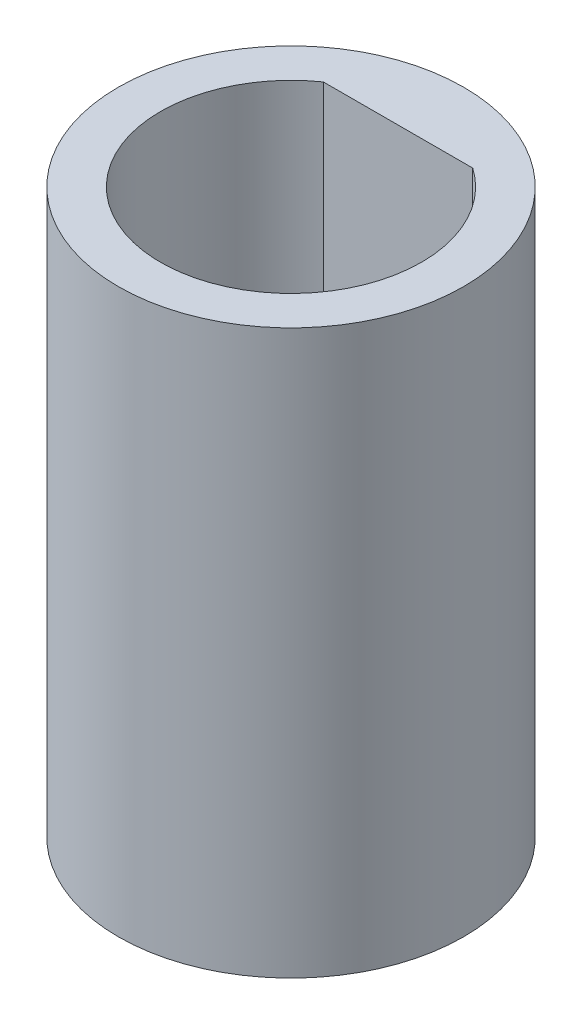
ISO-10303-21;
HEADER;
FILE_DESCRIPTION(('STEP AP214'),'2;1');
FILE_NAME('part.step','',(''),(''),'','','');
FILE_SCHEMA(('AUTOMOTIVE_DESIGN { 1 0 10303 214 1 1 1 1 }'));
ENDSEC;
DATA;
#1=APPLICATION_CONTEXT('core data for automotive mechanical design processes');
#2=APPLICATION_PROTOCOL_DEFINITION('international standard','automotive_design',2000,#1);
#3=PRODUCT_CONTEXT('',#1,'mechanical');
#4=PRODUCT('Part','Part','',(#3));
#5=PRODUCT_RELATED_PRODUCT_CATEGORY('part','',(#4));
#6=PRODUCT_DEFINITION_FORMATION('','',#4);
#7=PRODUCT_DEFINITION_CONTEXT('part definition',#1,'design');
#8=PRODUCT_DEFINITION('design','',#6,#7);
#9=PRODUCT_DEFINITION_SHAPE('','',#8);
#10=(LENGTH_UNIT() NAMED_UNIT(*) SI_UNIT(.MILLI.,.METRE.));
#11=(NAMED_UNIT(*) PLANE_ANGLE_UNIT() SI_UNIT($,.RADIAN.));
#12=(NAMED_UNIT(*) SI_UNIT($,.STERADIAN.) SOLID_ANGLE_UNIT());
#13=UNCERTAINTY_MEASURE_WITH_UNIT(LENGTH_MEASURE(1.E-05),#10,'distance_accuracy_value','');
#14=(GEOMETRIC_REPRESENTATION_CONTEXT(3) GLOBAL_UNCERTAINTY_ASSIGNED_CONTEXT((#13)) GLOBAL_UNIT_ASSIGNED_CONTEXT((#10,
#11,#12)) REPRESENTATION_CONTEXT('',''));
#15=CARTESIAN_POINT('',(0.,0.,0.));
#16=DIRECTION('',(0.,0.,1.));
#17=DIRECTION('',(1.,0.,0.));
#18=AXIS2_PLACEMENT_3D('',#15,#16,#17);
#19=CARTESIAN_POINT('',(0.,19.05,0.));
#20=DIRECTION('',(0.,-1.,0.));
#21=DIRECTION('',(0.,0.,-1.));
#22=AXIS2_PLACEMENT_3D('',#19,#20,#21);
#23=CYLINDRICAL_SURFACE('',#22,5.842);
#24=CARTESIAN_POINT('',(0.,19.05,0.));
#25=DIRECTION('',(0.,1.,0.));
#26=DIRECTION('',(0.,0.,1.));
#27=AXIS2_PLACEMENT_3D('',#24,#25,#26);
#28=CIRCLE('',#27,5.842);
#29=CARTESIAN_POINT('',(0.,19.05,5.842));
#30=VERTEX_POINT('',#29);
#31=EDGE_CURVE('E75',#30,#30,#28,.T.);
#32=ORIENTED_EDGE('',*,*,#31,.F.);
#33=EDGE_LOOP('',(#32));
#34=FACE_BOUND('',#33,.T.);
#35=CARTESIAN_POINT('',(0.,0.,0.));
#36=DIRECTION('',(0.,1.,0.));
#37=DIRECTION('',(0.,0.,1.));
#38=AXIS2_PLACEMENT_3D('',#35,#36,#37);
#39=CIRCLE('',#38,5.842);
#40=CARTESIAN_POINT('',(0.,0.,5.842));
#41=VERTEX_POINT('',#40);
#42=EDGE_CURVE('E62',#41,#41,#39,.T.);
#43=ORIENTED_EDGE('',*,*,#42,.T.);
#44=EDGE_LOOP('',(#43));
#45=FACE_BOUND('',#44,.T.);
#46=ADVANCED_FACE('F34',(#34,#45),#23,.T.);
#47=CARTESIAN_POINT('',(0.,19.05,0.));
#48=DIRECTION('',(0.,1.,0.));
#49=DIRECTION('',(0.,0.,1.));
#50=AXIS2_PLACEMENT_3D('',#47,#48,#49);
#51=PLANE('',#50);
#52=CARTESIAN_POINT('',(0.,19.05,0.));
#53=DIRECTION('',(0.,1.,0.));
#54=DIRECTION('',(0.,0.,1.));
#55=AXIS2_PLACEMENT_3D('',#52,#53,#54);
#56=CIRCLE('',#55,4.41681044219158);
#57=CARTESIAN_POINT('',(-2.52774834814084,19.05,-3.62197498206764));
#58=VERTEX_POINT('',#57);
#59=CARTESIAN_POINT('',(2.52239878623333,19.05,-3.62570253129807));
#60=VERTEX_POINT('',#59);
#61=EDGE_CURVE('E48',#58,#60,#56,.T.);
#62=ORIENTED_EDGE('',*,*,#61,.F.);
#63=DIRECTION('',(-0.999999727599099,0.,0.000738106854287479));
#64=VECTOR('',#63,1.);
#65=CARTESIAN_POINT('',(-2.52774834814084,19.05,-3.62197498206764));
#66=LINE('',#65,#64);
#67=EDGE_CURVE('E66',#60,#58,#66,.T.);
#68=ORIENTED_EDGE('',*,*,#67,.F.);
#69=EDGE_LOOP('',(#62,#68));
#70=FACE_BOUND('',#69,.T.);
#71=ORIENTED_EDGE('',*,*,#31,.T.);
#72=EDGE_LOOP('',(#71));
#73=FACE_BOUND('',#72,.T.);
#74=ADVANCED_FACE('F70',(#70,#73),#51,.T.);
#75=CARTESIAN_POINT('',(0.,0.,0.));
#76=DIRECTION('',(0.,1.,0.));
#77=DIRECTION('',(0.,0.,1.));
#78=AXIS2_PLACEMENT_3D('',#75,#76,#77);
#79=PLANE('',#78);
#80=DIRECTION('',(-0.999999727599099,0.,0.000738106854287479));
#81=VECTOR('',#80,1.);
#82=CARTESIAN_POINT('',(-0.00267478095375297,0.,-3.62383875668286));
#83=LINE('',#82,#81);
#84=CARTESIAN_POINT('',(2.52239878623333,0.,-3.62570253129807));
#85=VERTEX_POINT('',#84);
#86=CARTESIAN_POINT('',(-2.52774834814084,0.,-3.62197498206764));
#87=VERTEX_POINT('',#86);
#88=EDGE_CURVE('E41',#85,#87,#83,.T.);
#89=ORIENTED_EDGE('',*,*,#88,.T.);
#90=CARTESIAN_POINT('',(0.,0.,0.));
#91=DIRECTION('',(0.,1.,0.));
#92=DIRECTION('',(0.,0.,1.));
#93=AXIS2_PLACEMENT_3D('',#90,#91,#92);
#94=CIRCLE('',#93,4.41681044219158);
#95=EDGE_CURVE('E11',#87,#85,#94,.T.);
#96=ORIENTED_EDGE('',*,*,#95,.T.);
#97=EDGE_LOOP('',(#89,#96));
#98=FACE_BOUND('',#97,.T.);
#99=ORIENTED_EDGE('',*,*,#42,.F.);
#100=EDGE_LOOP('',(#99));
#101=FACE_BOUND('',#100,.T.);
#102=ADVANCED_FACE('F80',(#98,#101),#79,.F.);
#103=CARTESIAN_POINT('',(0.,-0.000100076000000837,0.));
#104=DIRECTION('',(0.,1.,0.));
#105=DIRECTION('',(0.,0.,1.));
#106=AXIS2_PLACEMENT_3D('',#103,#104,#105);
#107=CYLINDRICAL_SURFACE('',#106,4.41681044219158);
#108=DIRECTION('',(0.,1.,0.));
#109=VECTOR('',#108,1.);
#110=CARTESIAN_POINT('',(-2.52774834814084,-0.000100076000000837,-3.62197498206764));
#111=LINE('',#110,#109);
#112=EDGE_CURVE('E55',#87,#58,#111,.T.);
#113=ORIENTED_EDGE('',*,*,#112,.T.);
#114=ORIENTED_EDGE('',*,*,#61,.T.);
#115=DIRECTION('',(0.,1.,0.));
#116=VECTOR('',#115,1.);
#117=CARTESIAN_POINT('',(2.52239878623333,-0.000100076000000837,-3.62570253129807));
#118=LINE('',#117,#116);
#119=EDGE_CURVE('E63',#85,#60,#118,.T.);
#120=ORIENTED_EDGE('',*,*,#119,.F.);
#121=ORIENTED_EDGE('',*,*,#95,.F.);
#122=EDGE_LOOP('',(#113,#114,#120,#121));
#123=FACE_BOUND('',#122,.T.);
#124=ADVANCED_FACE('F60',(#123),#107,.F.);
#125=CARTESIAN_POINT('',(-2.52774834814084,-0.000100076000000837,-3.62197498206764));
#126=DIRECTION('',(-0.000738106854287479,0.,-0.999999727599099));
#127=DIRECTION('',(-0.999999727599099,0.,0.000738106854287479));
#128=AXIS2_PLACEMENT_3D('',#125,#126,#127);
#129=PLANE('',#128);
#130=ORIENTED_EDGE('',*,*,#119,.T.);
#131=ORIENTED_EDGE('',*,*,#67,.T.);
#132=ORIENTED_EDGE('',*,*,#112,.F.);
#133=ORIENTED_EDGE('',*,*,#88,.F.);
#134=EDGE_LOOP('',(#130,#131,#132,#133));
#135=FACE_BOUND('',#134,.T.);
#136=ADVANCED_FACE('F67',(#135),#129,.F.);
#137=CLOSED_SHELL('',(#46,#74,#102,#124,#136));
#138=MANIFOLD_SOLID_BREP('B2',#137);
#139=ADVANCED_BREP_SHAPE_REPRESENTATION('',(#18,#138),#14);
#140=SHAPE_DEFINITION_REPRESENTATION(#9,#139);
ENDSEC;
END-ISO-10303-21;
